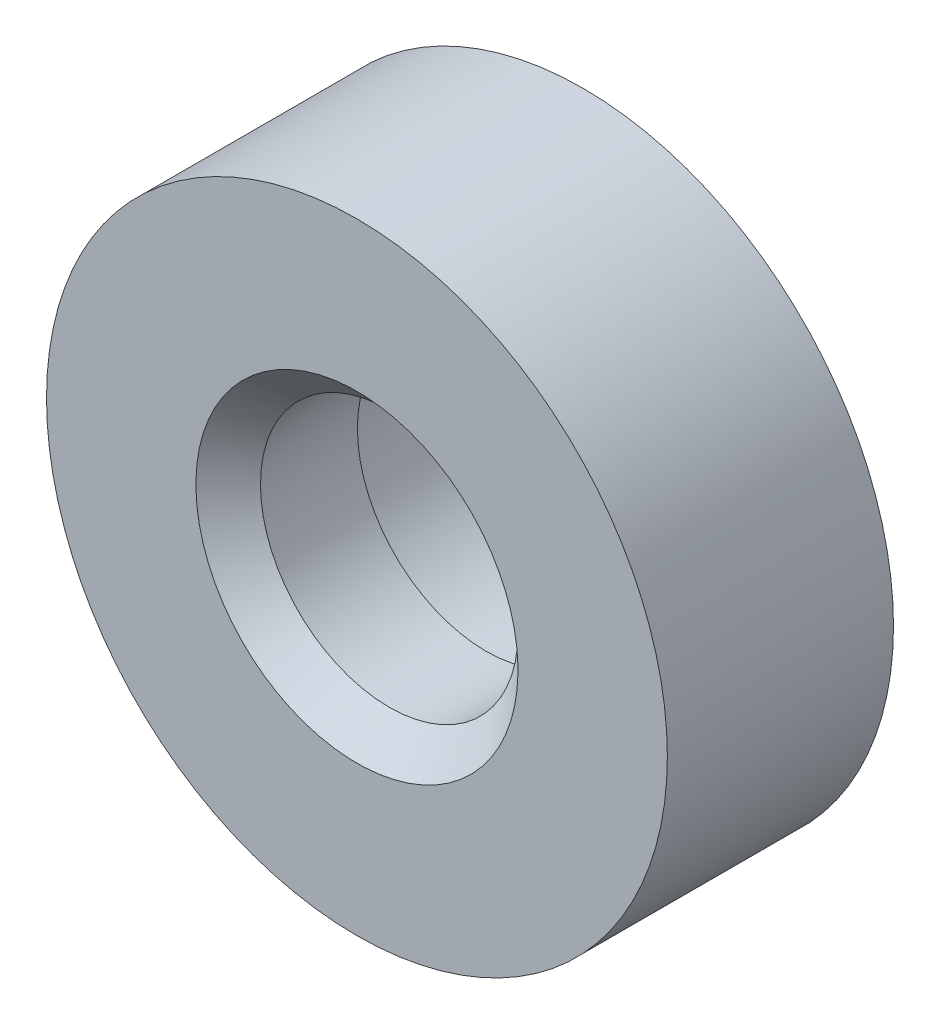
ISO-10303-21;
HEADER;
FILE_DESCRIPTION(('STEP AP214'),'2;1');
FILE_NAME('part.step','',(''),(''),'','','');
FILE_SCHEMA(('AUTOMOTIVE_DESIGN { 1 0 10303 214 1 1 1 1 }'));
ENDSEC;
DATA;
#1=APPLICATION_CONTEXT('core data for automotive mechanical design processes');
#2=APPLICATION_PROTOCOL_DEFINITION('international standard','automotive_design',2000,#1);
#3=PRODUCT_CONTEXT('',#1,'mechanical');
#4=PRODUCT('Part','Part','',(#3));
#5=PRODUCT_RELATED_PRODUCT_CATEGORY('part','',(#4));
#6=PRODUCT_DEFINITION_FORMATION('','',#4);
#7=PRODUCT_DEFINITION_CONTEXT('part definition',#1,'design');
#8=PRODUCT_DEFINITION('design','',#6,#7);
#9=PRODUCT_DEFINITION_SHAPE('','',#8);
#10=(LENGTH_UNIT() NAMED_UNIT(*) SI_UNIT(.MILLI.,.METRE.));
#11=(NAMED_UNIT(*) PLANE_ANGLE_UNIT() SI_UNIT($,.RADIAN.));
#12=(NAMED_UNIT(*) SI_UNIT($,.STERADIAN.) SOLID_ANGLE_UNIT());
#13=UNCERTAINTY_MEASURE_WITH_UNIT(LENGTH_MEASURE(1.E-05),#10,'distance_accuracy_value','');
#14=(GEOMETRIC_REPRESENTATION_CONTEXT(3) GLOBAL_UNCERTAINTY_ASSIGNED_CONTEXT((#13)) GLOBAL_UNIT_ASSIGNED_CONTEXT((#10,
#11,#12)) REPRESENTATION_CONTEXT('',''));
#15=CARTESIAN_POINT('',(0.,0.,0.));
#16=DIRECTION('',(0.,0.,1.));
#17=DIRECTION('',(1.,0.,0.));
#18=AXIS2_PLACEMENT_3D('',#15,#16,#17);
#19=CARTESIAN_POINT('',(6.73142857142744,1.90494344663256E-13,-172.459781675512));
#20=DIRECTION('',(0.,0.,-1.));
#21=DIRECTION('',(-1.,0.,0.));
#22=AXIS2_PLACEMENT_3D('',#19,#20,#21);
#23=CYLINDRICAL_SURFACE('',#22,1.54999999999984);
#24=CARTESIAN_POINT('',(6.73142857142744,1.90494344663256E-13,-179.459781675512));
#25=DIRECTION('',(0.,0.,1.));
#26=DIRECTION('',(1.,0.,0.));
#27=AXIS2_PLACEMENT_3D('',#24,#25,#26);
#28=CIRCLE('',#27,1.54999999999984);
#29=CARTESIAN_POINT('',(8.28142857142728,1.90494344663256E-13,-179.459781675512));
#30=VERTEX_POINT('',#29);
#31=EDGE_CURVE('E132',#30,#30,#28,.T.);
#32=ORIENTED_EDGE('',*,*,#31,.F.);
#33=EDGE_LOOP('',(#32));
#34=FACE_BOUND('',#33,.T.);
#35=CARTESIAN_POINT('',(6.73142857142744,1.90494344663256E-13,-175.459781675512));
#36=DIRECTION('',(0.,0.,1.));
#37=DIRECTION('',(1.,0.,0.));
#38=AXIS2_PLACEMENT_3D('',#35,#36,#37);
#39=CIRCLE('',#38,1.54999999999984);
#40=CARTESIAN_POINT('',(8.28142857142728,1.90494344663256E-13,-175.459781675512));
#41=VERTEX_POINT('',#40);
#42=EDGE_CURVE('E89',#41,#41,#39,.T.);
#43=ORIENTED_EDGE('',*,*,#42,.T.);
#44=EDGE_LOOP('',(#43));
#45=FACE_BOUND('',#44,.T.);
#46=ADVANCED_FACE('F39',(#34,#45),#23,.F.);
#47=CARTESIAN_POINT('',(-6.73142857142706,-1.91318706908625E-13,-172.459781675512));
#48=DIRECTION('',(0.,0.,-1.));
#49=DIRECTION('',(-1.,0.,0.));
#50=AXIS2_PLACEMENT_3D('',#47,#48,#49);
#51=CYLINDRICAL_SURFACE('',#50,1.55);
#52=CARTESIAN_POINT('',(-6.73142857142706,-1.91318706908625E-13,-179.459781675512));
#53=DIRECTION('',(0.,0.,1.));
#54=DIRECTION('',(1.,0.,0.));
#55=AXIS2_PLACEMENT_3D('',#52,#53,#54);
#56=CIRCLE('',#55,1.55);
#57=CARTESIAN_POINT('',(-5.18142857142706,-1.91318706908625E-13,-179.459781675512));
#58=VERTEX_POINT('',#57);
#59=EDGE_CURVE('E136',#58,#58,#56,.T.);
#60=ORIENTED_EDGE('',*,*,#59,.F.);
#61=EDGE_LOOP('',(#60));
#62=FACE_BOUND('',#61,.T.);
#63=CARTESIAN_POINT('',(-6.73142857142706,-1.91318706908625E-13,-175.459781675512));
#64=DIRECTION('',(0.,0.,1.));
#65=DIRECTION('',(1.,0.,0.));
#66=AXIS2_PLACEMENT_3D('',#63,#64,#65);
#67=CIRCLE('',#66,1.55);
#68=CARTESIAN_POINT('',(-5.18142857142706,-1.91318706908625E-13,-175.459781675512));
#69=VERTEX_POINT('',#68);
#70=EDGE_CURVE('E92',#69,#69,#67,.T.);
#71=ORIENTED_EDGE('',*,*,#70,.T.);
#72=EDGE_LOOP('',(#71));
#73=FACE_BOUND('',#72,.T.);
#74=ADVANCED_FACE('F156',(#62,#73),#51,.F.);
#75=CARTESIAN_POINT('',(0.,0.,-172.459781675512));
#76=DIRECTION('',(0.,0.,-1.));
#77=DIRECTION('',(-1.,0.,0.));
#78=AXIS2_PLACEMENT_3D('',#75,#76,#77);
#79=CYLINDRICAL_SURFACE('',#78,3.9857142857135);
#80=CARTESIAN_POINT('',(0.,0.,-173.459781675512));
#81=DIRECTION('',(0.,0.,1.));
#82=DIRECTION('',(1.,0.,0.));
#83=AXIS2_PLACEMENT_3D('',#80,#81,#82);
#84=CIRCLE('',#83,3.9857142857135);
#85=CARTESIAN_POINT('',(3.9857142857135,0.,-173.459781675512));
#86=VERTEX_POINT('',#85);
#87=EDGE_CURVE('E73',#86,#86,#84,.T.);
#88=ORIENTED_EDGE('',*,*,#87,.T.);
#89=EDGE_LOOP('',(#88));
#90=FACE_BOUND('',#89,.T.);
#91=CARTESIAN_POINT('',(0.,0.,-176.459781675512));
#92=DIRECTION('',(0.,0.,-1.));
#93=DIRECTION('',(-1.,0.,0.));
#94=AXIS2_PLACEMENT_3D('',#91,#92,#93);
#95=CIRCLE('',#94,3.9857142857135);
#96=CARTESIAN_POINT('',(-3.9857142857135,0.,-176.459781675512));
#97=VERTEX_POINT('',#96);
#98=EDGE_CURVE('E140',#97,#97,#95,.T.);
#99=ORIENTED_EDGE('',*,*,#98,.T.);
#100=EDGE_LOOP('',(#99));
#101=FACE_BOUND('',#100,.T.);
#102=ADVANCED_FACE('F107',(#90,#101),#79,.F.);
#103=CARTESIAN_POINT('',(0.,0.,-172.459781675512));
#104=DIRECTION('',(0.,0.,1.));
#105=DIRECTION('',(1.,0.,0.));
#106=AXIS2_PLACEMENT_3D('',#103,#104,#105);
#107=PLANE('',#106);
#108=CARTESIAN_POINT('',(0.,0.,-172.459781675512));
#109=DIRECTION('',(0.,0.,1.));
#110=DIRECTION('',(1.,0.,0.));
#111=AXIS2_PLACEMENT_3D('',#108,#109,#110);
#112=CIRCLE('',#111,4.98571428571349);
#113=CARTESIAN_POINT('',(-4.9846014734406,0.105333231894665,-172.459781675512));
#114=VERTEX_POINT('',#113);
#115=CARTESIAN_POINT('',(4.98460147344074,0.105333231888096,-172.459781675512));
#116=VERTEX_POINT('',#115);
#117=EDGE_CURVE('E51',#114,#116,#112,.F.);
#118=ORIENTED_EDGE('',*,*,#117,.T.);
#119=CARTESIAN_POINT('',(4.98460147344074,0.105333231888097,-172.459781675512));
#120=DIRECTION('',(0.,-1.,0.));
#121=VECTOR('',#120,1.);
#122=LINE('',#119,#121);
#123=CARTESIAN_POINT('',(4.98460147344074,-0.105333231887814,-172.459781675512));
#124=VERTEX_POINT('',#123);
#125=EDGE_CURVE('E62',#116,#124,#122,.T.);
#126=ORIENTED_EDGE('',*,*,#125,.T.);
#127=CARTESIAN_POINT('',(-4.98460147344059,-0.105333231894948,-172.459781675512));
#128=VERTEX_POINT('',#127);
#129=EDGE_CURVE('E58',#124,#128,#112,.F.);
#130=ORIENTED_EDGE('',*,*,#129,.T.);
#131=CARTESIAN_POINT('',(-4.98460147344059,-0.105333231894948,-172.459781675512));
#132=DIRECTION('',(0.,1.,0.));
#133=VECTOR('',#132,1.);
#134=LINE('',#131,#133);
#135=EDGE_CURVE('E11',#128,#114,#134,.T.);
#136=ORIENTED_EDGE('',*,*,#135,.T.);
#137=EDGE_LOOP('',(#118,#126,#130,#136));
#138=FACE_BOUND('',#137,.T.);
#139=CARTESIAN_POINT('',(0.,0.,-172.459781675512));
#140=DIRECTION('',(0.,0.,1.));
#141=DIRECTION('',(1.,0.,0.));
#142=AXIS2_PLACEMENT_3D('',#139,#140,#141);
#143=CIRCLE('',#142,9.60999999999811);
#144=CARTESIAN_POINT('',(9.60999999999811,0.,-172.459781675512));
#145=VERTEX_POINT('',#144);
#146=EDGE_CURVE('E124',#145,#145,#143,.T.);
#147=ORIENTED_EDGE('',*,*,#146,.T.);
#148=EDGE_LOOP('',(#147));
#149=FACE_BOUND('',#148,.T.);
#150=ADVANCED_FACE('F68',(#138,#149),#107,.T.);
#151=CARTESIAN_POINT('',(0.,0.,-179.459781675512));
#152=DIRECTION('',(0.,0.,1.));
#153=DIRECTION('',(1.,0.,0.));
#154=AXIS2_PLACEMENT_3D('',#151,#152,#153);
#155=PLANE('',#154);
#156=CARTESIAN_POINT('',(0.,0.,-179.459781675512));
#157=DIRECTION('',(0.,0.,1.));
#158=DIRECTION('',(1.,0.,0.));
#159=AXIS2_PLACEMENT_3D('',#156,#157,#158);
#160=CIRCLE('',#159,4.5);
#161=CARTESIAN_POINT('',(4.5,0.,-179.459781675512));
#162=VERTEX_POINT('',#161);
#163=EDGE_CURVE('E144',#162,#162,#160,.T.);
#164=ORIENTED_EDGE('',*,*,#163,.T.);
#165=EDGE_LOOP('',(#164));
#166=FACE_BOUND('',#165,.T.);
#167=CARTESIAN_POINT('',(0.,0.,-179.459781675512));
#168=DIRECTION('',(0.,0.,1.));
#169=DIRECTION('',(1.,0.,0.));
#170=AXIS2_PLACEMENT_3D('',#167,#168,#169);
#171=CIRCLE('',#170,9.60999999999811);
#172=CARTESIAN_POINT('',(9.60999999999811,0.,-179.459781675512));
#173=VERTEX_POINT('',#172);
#174=EDGE_CURVE('E128',#173,#173,#171,.T.);
#175=ORIENTED_EDGE('',*,*,#174,.F.);
#176=EDGE_LOOP('',(#175));
#177=FACE_BOUND('',#176,.T.);
#178=ORIENTED_EDGE('',*,*,#31,.T.);
#179=EDGE_LOOP('',(#178));
#180=FACE_BOUND('',#179,.T.);
#181=ORIENTED_EDGE('',*,*,#59,.T.);
#182=EDGE_LOOP('',(#181));
#183=FACE_BOUND('',#182,.T.);
#184=ADVANCED_FACE('F106',(#166,#177,#180,#183),#155,.F.);
#185=CARTESIAN_POINT('',(0.,0.,-172.459781675512));
#186=DIRECTION('',(0.,0.,-1.));
#187=DIRECTION('',(-1.,0.,0.));
#188=AXIS2_PLACEMENT_3D('',#185,#186,#187);
#189=CYLINDRICAL_SURFACE('',#188,9.60999999999811);
#190=ORIENTED_EDGE('',*,*,#146,.F.);
#191=EDGE_LOOP('',(#190));
#192=FACE_BOUND('',#191,.T.);
#193=ORIENTED_EDGE('',*,*,#174,.T.);
#194=EDGE_LOOP('',(#193));
#195=FACE_BOUND('',#194,.T.);
#196=ADVANCED_FACE('F184',(#192,#195),#189,.T.);
#197=CARTESIAN_POINT('',(0.,0.,-176.459781675512));
#198=DIRECTION('',(0.,0.,1.));
#199=DIRECTION('',(1.,0.,0.));
#200=AXIS2_PLACEMENT_3D('',#197,#198,#199);
#201=PLANE('',#200);
#202=CARTESIAN_POINT('',(0.,0.,-176.459781675512));
#203=DIRECTION('',(0.,0.,1.));
#204=DIRECTION('',(1.,0.,0.));
#205=AXIS2_PLACEMENT_3D('',#202,#203,#204);
#206=CIRCLE('',#205,4.5);
#207=CARTESIAN_POINT('',(4.5,0.,-176.459781675512));
#208=VERTEX_POINT('',#207);
#209=EDGE_CURVE('E148',#208,#208,#206,.T.);
#210=ORIENTED_EDGE('',*,*,#209,.F.);
#211=EDGE_LOOP('',(#210));
#212=FACE_BOUND('',#211,.T.);
#213=ORIENTED_EDGE('',*,*,#98,.F.);
#214=EDGE_LOOP('',(#213));
#215=FACE_BOUND('',#214,.T.);
#216=ADVANCED_FACE('F181',(#212,#215),#201,.F.);
#217=CARTESIAN_POINT('',(0.,0.,-182.459781675512));
#218=DIRECTION('',(0.,0.,1.));
#219=DIRECTION('',(1.,0.,0.));
#220=AXIS2_PLACEMENT_3D('',#217,#218,#219);
#221=CYLINDRICAL_SURFACE('',#220,4.5);
#222=ORIENTED_EDGE('',*,*,#209,.T.);
#223=EDGE_LOOP('',(#222));
#224=FACE_BOUND('',#223,.T.);
#225=ORIENTED_EDGE('',*,*,#163,.F.);
#226=EDGE_LOOP('',(#225));
#227=FACE_BOUND('',#226,.T.);
#228=ADVANCED_FACE('F168',(#224,#227),#221,.F.);
#229=CARTESIAN_POINT('',(0.,0.,-173.459781675512));
#230=DIRECTION('',(0.,0.,1.));
#231=DIRECTION('',(1.,0.,0.));
#232=AXIS2_PLACEMENT_3D('',#229,#230,#231);
#233=CONICAL_SURFACE('',#232,3.9857142857135,0.785398163397441);
#234=ORIENTED_EDGE('',*,*,#125,.F.);
#235=ORIENTED_EDGE('',*,*,#117,.F.);
#236=ORIENTED_EDGE('',*,*,#135,.F.);
#237=ORIENTED_EDGE('',*,*,#129,.F.);
#238=EDGE_LOOP('',(#234,#235,#236,#237));
#239=FACE_BOUND('',#238,.T.);
#240=ORIENTED_EDGE('',*,*,#87,.F.);
#241=EDGE_LOOP('',(#240));
#242=FACE_BOUND('',#241,.T.);
#243=ADVANCED_FACE('F41',(#239,#242),#233,.F.);
#244=CARTESIAN_POINT('',(-6.73142857142706,-1.91318706908625E-13,-175.459781675512));
#245=DIRECTION('',(0.,0.,1.));
#246=DIRECTION('',(1.,0.,0.));
#247=AXIS2_PLACEMENT_3D('',#244,#245,#246);
#248=PLANE('',#247);
#249=ORIENTED_EDGE('',*,*,#70,.F.);
#250=EDGE_LOOP('',(#249));
#251=FACE_BOUND('',#250,.T.);
#252=ADVANCED_FACE('F158',(#251),#248,.F.);
#253=CARTESIAN_POINT('',(6.73142857142744,1.90494344663256E-13,-175.459781675512));
#254=DIRECTION('',(0.,0.,1.));
#255=DIRECTION('',(1.,0.,0.));
#256=AXIS2_PLACEMENT_3D('',#253,#254,#255);
#257=PLANE('',#256);
#258=ORIENTED_EDGE('',*,*,#42,.F.);
#259=EDGE_LOOP('',(#258));
#260=FACE_BOUND('',#259,.T.);
#261=ADVANCED_FACE('F160',(#260),#257,.F.);
#262=CLOSED_SHELL('',(#46,#74,#102,#150,#184,#196,#216,#228,#243,#252,#261));
#263=MANIFOLD_SOLID_BREP('B2',#262);
#264=ADVANCED_BREP_SHAPE_REPRESENTATION('',(#18,#263),#14);
#265=SHAPE_DEFINITION_REPRESENTATION(#9,#264);
ENDSEC;
END-ISO-10303-21;
